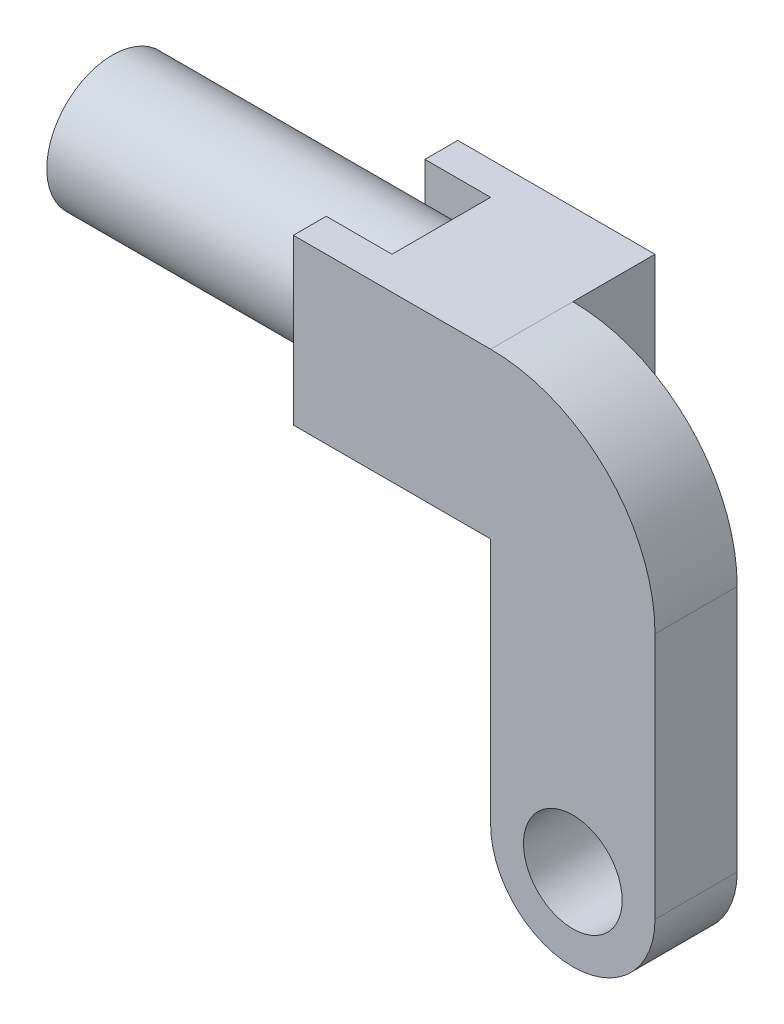
ISO-10303-21;
HEADER;
FILE_DESCRIPTION(('STEP AP214'),'2;1');
FILE_NAME('part.step','',(''),(''),'','','');
FILE_SCHEMA(('AUTOMOTIVE_DESIGN { 1 0 10303 214 1 1 1 1 }'));
ENDSEC;
DATA;
#1=APPLICATION_CONTEXT('core data for automotive mechanical design processes');
#2=APPLICATION_PROTOCOL_DEFINITION('international standard','automotive_design',2000,#1);
#3=PRODUCT_CONTEXT('',#1,'mechanical');
#4=PRODUCT('Part','Part','',(#3));
#5=PRODUCT_RELATED_PRODUCT_CATEGORY('part','',(#4));
#6=PRODUCT_DEFINITION_FORMATION('','',#4);
#7=PRODUCT_DEFINITION_CONTEXT('part definition',#1,'design');
#8=PRODUCT_DEFINITION('design','',#6,#7);
#9=PRODUCT_DEFINITION_SHAPE('','',#8);
#10=(LENGTH_UNIT() NAMED_UNIT(*) SI_UNIT(.MILLI.,.METRE.));
#11=(NAMED_UNIT(*) PLANE_ANGLE_UNIT() SI_UNIT($,.RADIAN.));
#12=(NAMED_UNIT(*) SI_UNIT($,.STERADIAN.) SOLID_ANGLE_UNIT());
#13=UNCERTAINTY_MEASURE_WITH_UNIT(LENGTH_MEASURE(1.E-05),#10,'distance_accuracy_value','');
#14=(GEOMETRIC_REPRESENTATION_CONTEXT(3) GLOBAL_UNCERTAINTY_ASSIGNED_CONTEXT((#13)) GLOBAL_UNIT_ASSIGNED_CONTEXT((#10,
#11,#12)) REPRESENTATION_CONTEXT('',''));
#15=CARTESIAN_POINT('',(0.,0.,0.));
#16=DIRECTION('',(0.,0.,1.));
#17=DIRECTION('',(1.,0.,0.));
#18=AXIS2_PLACEMENT_3D('',#15,#16,#17);
#19=CARTESIAN_POINT('',(88.9,0.,0.));
#20=DIRECTION('',(1.,0.,0.));
#21=DIRECTION('',(0.,0.,-1.));
#22=AXIS2_PLACEMENT_3D('',#19,#20,#21);
#23=PLANE('',#22);
#24=DIRECTION('',(0.,0.,1.));
#25=VECTOR('',#24,1.);
#26=CARTESIAN_POINT('',(88.9,15.875,15.875));
#27=LINE('',#26,#25);
#28=CARTESIAN_POINT('',(88.9,15.875,-15.875));
#29=VERTEX_POINT('',#28);
#30=CARTESIAN_POINT('',(88.9,15.875,0.));
#31=VERTEX_POINT('',#30);
#32=EDGE_CURVE('E294',#29,#31,#27,.T.);
#33=ORIENTED_EDGE('',*,*,#32,.T.);
#34=DIRECTION('',(0.,-1.,0.));
#35=VECTOR('',#34,1.);
#36=CARTESIAN_POINT('',(88.9,0.,0.));
#37=LINE('',#36,#35);
#38=CARTESIAN_POINT('',(88.9,-15.875,0.));
#39=VERTEX_POINT('',#38);
#40=EDGE_CURVE('E12',#31,#39,#37,.T.);
#41=ORIENTED_EDGE('',*,*,#40,.T.);
#42=DIRECTION('',(0.,0.,-1.));
#43=VECTOR('',#42,1.);
#44=CARTESIAN_POINT('',(88.9,-15.875,15.875));
#45=LINE('',#44,#43);
#46=CARTESIAN_POINT('',(88.9,-15.875,-15.875));
#47=VERTEX_POINT('',#46);
#48=EDGE_CURVE('E297',#39,#47,#45,.T.);
#49=ORIENTED_EDGE('',*,*,#48,.T.);
#50=DIRECTION('',(0.,1.,0.));
#51=VECTOR('',#50,1.);
#52=CARTESIAN_POINT('',(88.9,15.875,-15.875));
#53=LINE('',#52,#51);
#54=EDGE_CURVE('E291',#47,#29,#53,.T.);
#55=ORIENTED_EDGE('',*,*,#54,.T.);
#56=EDGE_LOOP('',(#33,#41,#49,#55));
#57=FACE_BOUND('',#56,.T.);
#58=ADVANCED_FACE('F81',(#57),#23,.T.);
#59=CARTESIAN_POINT('',(63.5,0.,0.));
#60=DIRECTION('',(-1.,0.,0.));
#61=DIRECTION('',(0.,0.,1.));
#62=AXIS2_PLACEMENT_3D('',#59,#60,#61);
#63=CYLINDRICAL_SURFACE('',#62,12.7);
#64=CARTESIAN_POINT('',(0.,0.,0.));
#65=DIRECTION('',(1.,0.,0.));
#66=DIRECTION('',(0.,0.,-1.));
#67=AXIS2_PLACEMENT_3D('',#64,#65,#66);
#68=CIRCLE('',#67,12.7);
#69=CARTESIAN_POINT('',(0.,0.,-12.7));
#70=VERTEX_POINT('',#69);
#71=EDGE_CURVE('E310',#70,#70,#68,.T.);
#72=ORIENTED_EDGE('',*,*,#71,.T.);
#73=EDGE_LOOP('',(#72));
#74=FACE_BOUND('',#73,.T.);
#75=DIRECTION('',(-1.,0.,0.));
#76=VECTOR('',#75,1.);
#77=CARTESIAN_POINT('',(63.5,8.40026041263007,9.525));
#78=LINE('',#77,#76);
#79=CARTESIAN_POINT('',(63.5,8.40026041263007,9.525));
#80=VERTEX_POINT('',#79);
#81=CARTESIAN_POINT('',(50.8,8.40026041263007,9.525));
#82=VERTEX_POINT('',#81);
#83=EDGE_CURVE('E262',#80,#82,#78,.T.);
#84=ORIENTED_EDGE('',*,*,#83,.F.);
#85=CARTESIAN_POINT('',(63.5,0.,0.));
#86=DIRECTION('',(1.,0.,0.));
#87=DIRECTION('',(0.,0.,-1.));
#88=AXIS2_PLACEMENT_3D('',#85,#86,#87);
#89=CIRCLE('',#88,12.7);
#90=CARTESIAN_POINT('',(63.5,8.40026041263007,-9.525));
#91=VERTEX_POINT('',#90);
#92=EDGE_CURVE('E311',#91,#80,#89,.T.);
#93=ORIENTED_EDGE('',*,*,#92,.F.);
#94=DIRECTION('',(-1.,0.,0.));
#95=VECTOR('',#94,1.);
#96=CARTESIAN_POINT('',(63.5,8.40026041263007,-9.525));
#97=LINE('',#96,#95);
#98=CARTESIAN_POINT('',(50.8,8.40026041263007,-9.525));
#99=VERTEX_POINT('',#98);
#100=EDGE_CURVE('E284',#99,#91,#97,.F.);
#101=ORIENTED_EDGE('',*,*,#100,.F.);
#102=CARTESIAN_POINT('',(50.8,0.,0.));
#103=DIRECTION('',(-1.,0.,0.));
#104=DIRECTION('',(0.,-1.,0.));
#105=AXIS2_PLACEMENT_3D('',#102,#103,#104);
#106=CIRCLE('',#105,12.7);
#107=CARTESIAN_POINT('',(50.8,-8.40026041263007,-9.52500000000001));
#108=VERTEX_POINT('',#107);
#109=EDGE_CURVE('E320',#99,#108,#106,.T.);
#110=ORIENTED_EDGE('',*,*,#109,.T.);
#111=DIRECTION('',(-1.,0.,0.));
#112=VECTOR('',#111,1.);
#113=CARTESIAN_POINT('',(63.5,-8.40026041263007,-9.52500000000001));
#114=LINE('',#113,#112);
#115=CARTESIAN_POINT('',(63.5,-8.40026041263007,-9.52500000000001));
#116=VERTEX_POINT('',#115);
#117=EDGE_CURVE('E288',#116,#108,#114,.T.);
#118=ORIENTED_EDGE('',*,*,#117,.F.);
#119=CARTESIAN_POINT('',(63.5,-8.40026041263007,9.52500000000001));
#120=VERTEX_POINT('',#119);
#121=EDGE_CURVE('E315',#120,#116,#89,.T.);
#122=ORIENTED_EDGE('',*,*,#121,.F.);
#123=DIRECTION('',(-1.,0.,0.));
#124=VECTOR('',#123,1.);
#125=CARTESIAN_POINT('',(63.5,-8.40026041263007,9.52500000000001));
#126=LINE('',#125,#124);
#127=CARTESIAN_POINT('',(50.8,-8.40026041263007,9.52500000000001));
#128=VERTEX_POINT('',#127);
#129=EDGE_CURVE('E258',#128,#120,#126,.F.);
#130=ORIENTED_EDGE('',*,*,#129,.F.);
#131=CARTESIAN_POINT('',(50.8,0.,0.));
#132=DIRECTION('',(1.,0.,0.));
#133=DIRECTION('',(0.,1.,0.));
#134=AXIS2_PLACEMENT_3D('',#131,#132,#133);
#135=CIRCLE('',#134,12.7);
#136=EDGE_CURVE('E89',#82,#128,#135,.T.);
#137=ORIENTED_EDGE('',*,*,#136,.F.);
#138=EDGE_LOOP('',(#84,#93,#101,#110,#118,#122,#130,#137));
#139=FACE_BOUND('',#138,.T.);
#140=ADVANCED_FACE('F83',(#74,#139),#63,.T.);
#141=CARTESIAN_POINT('',(63.5,0.,0.));
#142=DIRECTION('',(1.,0.,0.));
#143=DIRECTION('',(0.,0.,-1.));
#144=AXIS2_PLACEMENT_3D('',#141,#142,#143);
#145=PLANE('',#144);
#146=DIRECTION('',(0.,-1.,0.));
#147=VECTOR('',#146,1.);
#148=CARTESIAN_POINT('',(63.5,15.875,9.525));
#149=LINE('',#148,#147);
#150=CARTESIAN_POINT('',(63.5,15.875,9.525));
#151=VERTEX_POINT('',#150);
#152=EDGE_CURVE('E241',#151,#80,#149,.T.);
#153=ORIENTED_EDGE('',*,*,#152,.F.);
#154=DIRECTION('',(0.,0.,1.));
#155=VECTOR('',#154,1.);
#156=CARTESIAN_POINT('',(63.5,15.875,15.875));
#157=LINE('',#156,#155);
#158=CARTESIAN_POINT('',(63.5,15.875,-9.525));
#159=VERTEX_POINT('',#158);
#160=EDGE_CURVE('E290',#159,#151,#157,.T.);
#161=ORIENTED_EDGE('',*,*,#160,.F.);
#162=DIRECTION('',(0.,-1.,0.));
#163=VECTOR('',#162,1.);
#164=CARTESIAN_POINT('',(63.5,15.875,-9.525));
#165=LINE('',#164,#163);
#166=EDGE_CURVE('E265',#159,#91,#165,.T.);
#167=ORIENTED_EDGE('',*,*,#166,.T.);
#168=ORIENTED_EDGE('',*,*,#92,.T.);
#169=EDGE_LOOP('',(#153,#161,#167,#168));
#170=FACE_BOUND('',#169,.T.);
#171=ADVANCED_FACE('F382',(#170),#145,.F.);
#172=CARTESIAN_POINT('',(63.5,-15.875,9.52500000000001));
#173=VERTEX_POINT('',#172);
#174=EDGE_CURVE('E244',#120,#173,#149,.T.);
#175=ORIENTED_EDGE('',*,*,#174,.F.);
#176=ORIENTED_EDGE('',*,*,#121,.T.);
#177=DIRECTION('',(0.,1.,0.));
#178=VECTOR('',#177,1.);
#179=CARTESIAN_POINT('',(63.5,0.,-9.525));
#180=LINE('',#179,#178);
#181=CARTESIAN_POINT('',(63.5,-15.875,-9.52500000000001));
#182=VERTEX_POINT('',#181);
#183=EDGE_CURVE('E314',#182,#116,#180,.T.);
#184=ORIENTED_EDGE('',*,*,#183,.F.);
#185=DIRECTION('',(0.,0.,-1.));
#186=VECTOR('',#185,1.);
#187=CARTESIAN_POINT('',(63.5,-15.875,15.875));
#188=LINE('',#187,#186);
#189=EDGE_CURVE('E295',#173,#182,#188,.T.);
#190=ORIENTED_EDGE('',*,*,#189,.F.);
#191=EDGE_LOOP('',(#175,#176,#184,#190));
#192=FACE_BOUND('',#191,.T.);
#193=ADVANCED_FACE('F340',(#192),#145,.F.);
#194=CARTESIAN_POINT('',(0.,0.,0.));
#195=DIRECTION('',(1.,0.,0.));
#196=DIRECTION('',(0.,0.,-1.));
#197=AXIS2_PLACEMENT_3D('',#194,#195,#196);
#198=PLANE('',#197);
#199=ORIENTED_EDGE('',*,*,#71,.F.);
#200=EDGE_LOOP('',(#199));
#201=FACE_BOUND('',#200,.T.);
#202=ADVANCED_FACE('F398',(#201),#198,.F.);
#203=CARTESIAN_POINT('',(88.9,15.875,-15.875));
#204=DIRECTION('',(0.,0.,1.));
#205=DIRECTION('',(0.,-1.,0.));
#206=AXIS2_PLACEMENT_3D('',#203,#204,#205);
#207=PLANE('',#206);
#208=DIRECTION('',(-1.,0.,0.));
#209=VECTOR('',#208,1.);
#210=CARTESIAN_POINT('',(88.9,-15.875,-15.875));
#211=LINE('',#210,#209);
#212=CARTESIAN_POINT('',(50.8,-15.875,-15.875));
#213=VERTEX_POINT('',#212);
#214=EDGE_CURVE('E299',#47,#213,#211,.T.);
#215=ORIENTED_EDGE('',*,*,#214,.T.);
#216=DIRECTION('',(0.,1.,0.));
#217=VECTOR('',#216,1.);
#218=CARTESIAN_POINT('',(50.8,15.875,-15.875));
#219=LINE('',#218,#217);
#220=CARTESIAN_POINT('',(50.8,15.875,-15.875));
#221=VERTEX_POINT('',#220);
#222=EDGE_CURVE('E264',#213,#221,#219,.T.);
#223=ORIENTED_EDGE('',*,*,#222,.T.);
#224=DIRECTION('',(-1.,0.,0.));
#225=VECTOR('',#224,1.);
#226=CARTESIAN_POINT('',(88.9,15.875,-15.875));
#227=LINE('',#226,#225);
#228=EDGE_CURVE('E308',#29,#221,#227,.T.);
#229=ORIENTED_EDGE('',*,*,#228,.F.);
#230=ORIENTED_EDGE('',*,*,#54,.F.);
#231=EDGE_LOOP('',(#215,#223,#229,#230));
#232=FACE_BOUND('',#231,.T.);
#233=ADVANCED_FACE('F396',(#232),#207,.F.);
#234=CARTESIAN_POINT('',(88.9,15.875,15.875));
#235=DIRECTION('',(0.,-1.,0.));
#236=DIRECTION('',(0.,0.,-1.));
#237=AXIS2_PLACEMENT_3D('',#234,#235,#236);
#238=PLANE('',#237);
#239=ORIENTED_EDGE('',*,*,#228,.T.);
#240=DIRECTION('',(0.,0.,-1.));
#241=VECTOR('',#240,1.);
#242=CARTESIAN_POINT('',(50.8,15.875,-9.525));
#243=LINE('',#242,#241);
#244=CARTESIAN_POINT('',(50.8,15.875,-9.525));
#245=VERTEX_POINT('',#244);
#246=EDGE_CURVE('E281',#245,#221,#243,.T.);
#247=ORIENTED_EDGE('',*,*,#246,.F.);
#248=DIRECTION('',(1.,0.,0.));
#249=VECTOR('',#248,1.);
#250=CARTESIAN_POINT('',(63.5,15.875,-9.525));
#251=LINE('',#250,#249);
#252=EDGE_CURVE('E275',#245,#159,#251,.T.);
#253=ORIENTED_EDGE('',*,*,#252,.T.);
#254=ORIENTED_EDGE('',*,*,#160,.T.);
#255=DIRECTION('',(1.,0.,0.));
#256=VECTOR('',#255,1.);
#257=CARTESIAN_POINT('',(63.5,15.875,9.525));
#258=LINE('',#257,#256);
#259=CARTESIAN_POINT('',(50.8,15.875,9.525));
#260=VERTEX_POINT('',#259);
#261=EDGE_CURVE('E243',#260,#151,#258,.T.);
#262=ORIENTED_EDGE('',*,*,#261,.F.);
#263=DIRECTION('',(0.,0.,1.));
#264=VECTOR('',#263,1.);
#265=CARTESIAN_POINT('',(50.8,15.875,9.525));
#266=LINE('',#265,#264);
#267=CARTESIAN_POINT('',(50.8,15.875,15.875));
#268=VERTEX_POINT('',#267);
#269=EDGE_CURVE('E252',#260,#268,#266,.T.);
#270=ORIENTED_EDGE('',*,*,#269,.T.);
#271=DIRECTION('',(-1.,0.,0.));
#272=VECTOR('',#271,1.);
#273=CARTESIAN_POINT('',(88.9,15.875,15.875));
#274=LINE('',#273,#272);
#275=CARTESIAN_POINT('',(88.9,15.875,15.875));
#276=VERTEX_POINT('',#275);
#277=EDGE_CURVE('E306',#276,#268,#274,.T.);
#278=ORIENTED_EDGE('',*,*,#277,.F.);
#279=DIRECTION('',(0.,0.,1.));
#280=VECTOR('',#279,1.);
#281=CARTESIAN_POINT('',(88.9,15.875,0.));
#282=LINE('',#281,#280);
#283=EDGE_CURVE('E102',#31,#276,#282,.T.);
#284=ORIENTED_EDGE('',*,*,#283,.F.);
#285=ORIENTED_EDGE('',*,*,#32,.F.);
#286=EDGE_LOOP('',(#239,#247,#253,#254,#262,#270,#278,#284,#285));
#287=FACE_BOUND('',#286,.T.);
#288=ADVANCED_FACE('F356',(#287),#238,.F.);
#289=CARTESIAN_POINT('',(88.9,15.875,15.875));
#290=DIRECTION('',(0.,0.,-1.));
#291=DIRECTION('',(0.,1.,0.));
#292=AXIS2_PLACEMENT_3D('',#289,#290,#291);
#293=PLANE('',#292);
#294=ORIENTED_EDGE('',*,*,#277,.T.);
#295=DIRECTION('',(0.,1.,0.));
#296=VECTOR('',#295,1.);
#297=CARTESIAN_POINT('',(50.8,15.875,15.875));
#298=LINE('',#297,#296);
#299=CARTESIAN_POINT('',(50.8,-15.875,15.875));
#300=VERTEX_POINT('',#299);
#301=EDGE_CURVE('E231',#300,#268,#298,.T.);
#302=ORIENTED_EDGE('',*,*,#301,.F.);
#303=DIRECTION('',(-1.,0.,0.));
#304=VECTOR('',#303,1.);
#305=CARTESIAN_POINT('',(88.9,-15.875,15.875));
#306=LINE('',#305,#304);
#307=CARTESIAN_POINT('',(88.9,-15.875,15.875));
#308=VERTEX_POINT('',#307);
#309=EDGE_CURVE('E304',#308,#300,#306,.T.);
#310=ORIENTED_EDGE('',*,*,#309,.F.);
#311=DIRECTION('',(0.,1.,0.));
#312=VECTOR('',#311,1.);
#313=CARTESIAN_POINT('',(88.9,0.,15.875));
#314=LINE('',#313,#312);
#315=CARTESIAN_POINT('',(88.9,-63.627,15.875));
#316=VERTEX_POINT('',#315);
#317=EDGE_CURVE('E225',#316,#308,#314,.T.);
#318=ORIENTED_EDGE('',*,*,#317,.F.);
#319=CARTESIAN_POINT('',(104.775,-63.627,15.875));
#320=DIRECTION('',(0.,0.,1.));
#321=DIRECTION('',(1.,0.,0.));
#322=AXIS2_PLACEMENT_3D('',#319,#320,#321);
#323=CIRCLE('',#322,15.875);
#324=CARTESIAN_POINT('',(120.65,-63.627,15.875));
#325=VERTEX_POINT('',#324);
#326=EDGE_CURVE('E198',#316,#325,#323,.T.);
#327=ORIENTED_EDGE('',*,*,#326,.T.);
#328=DIRECTION('',(0.,1.,0.));
#329=VECTOR('',#328,1.);
#330=CARTESIAN_POINT('',(120.65,0.,15.875));
#331=LINE('',#330,#329);
#332=CARTESIAN_POINT('',(120.65,-15.875,15.875));
#333=VERTEX_POINT('',#332);
#334=EDGE_CURVE('E220',#325,#333,#331,.T.);
#335=ORIENTED_EDGE('',*,*,#334,.T.);
#336=CARTESIAN_POINT('',(88.9,-15.875,15.875));
#337=DIRECTION('',(0.,0.,1.));
#338=DIRECTION('',(1.,0.,0.));
#339=AXIS2_PLACEMENT_3D('',#336,#337,#338);
#340=CIRCLE('',#339,31.75);
#341=EDGE_CURVE('E212',#276,#333,#340,.F.);
#342=ORIENTED_EDGE('',*,*,#341,.F.);
#343=EDGE_LOOP('',(#294,#302,#310,#318,#327,#335,#342));
#344=FACE_BOUND('',#343,.T.);
#345=CARTESIAN_POINT('',(104.775,-63.627,15.875));
#346=DIRECTION('',(0.,0.,1.));
#347=DIRECTION('',(1.,0.,0.));
#348=AXIS2_PLACEMENT_3D('',#345,#346,#347);
#349=CIRCLE('',#348,9.52500000000001);
#350=CARTESIAN_POINT('',(114.3,-63.627,15.875));
#351=VERTEX_POINT('',#350);
#352=EDGE_CURVE('E237',#351,#351,#349,.T.);
#353=ORIENTED_EDGE('',*,*,#352,.F.);
#354=EDGE_LOOP('',(#353));
#355=FACE_BOUND('',#354,.T.);
#356=ADVANCED_FACE('F353',(#344,#355),#293,.F.);
#357=CARTESIAN_POINT('',(88.9,-15.875,15.875));
#358=DIRECTION('',(0.,1.,0.));
#359=DIRECTION('',(0.,0.,1.));
#360=AXIS2_PLACEMENT_3D('',#357,#358,#359);
#361=PLANE('',#360);
#362=ORIENTED_EDGE('',*,*,#309,.T.);
#363=DIRECTION('',(0.,0.,1.));
#364=VECTOR('',#363,1.);
#365=CARTESIAN_POINT('',(50.8,-15.875,9.52500000000001));
#366=LINE('',#365,#364);
#367=CARTESIAN_POINT('',(50.8,-15.875,9.52500000000001));
#368=VERTEX_POINT('',#367);
#369=EDGE_CURVE('E255',#368,#300,#366,.T.);
#370=ORIENTED_EDGE('',*,*,#369,.F.);
#371=DIRECTION('',(-1.,0.,0.));
#372=VECTOR('',#371,1.);
#373=CARTESIAN_POINT('',(63.5,-15.875,9.52500000000001));
#374=LINE('',#373,#372);
#375=EDGE_CURVE('E250',#173,#368,#374,.T.);
#376=ORIENTED_EDGE('',*,*,#375,.F.);
#377=ORIENTED_EDGE('',*,*,#189,.T.);
#378=DIRECTION('',(-1.,0.,0.));
#379=VECTOR('',#378,1.);
#380=CARTESIAN_POINT('',(63.5,-15.875,-9.52500000000001));
#381=LINE('',#380,#379);
#382=CARTESIAN_POINT('',(50.8,-15.875,-9.52500000000001));
#383=VERTEX_POINT('',#382);
#384=EDGE_CURVE('E268',#182,#383,#381,.T.);
#385=ORIENTED_EDGE('',*,*,#384,.T.);
#386=DIRECTION('',(0.,0.,-1.));
#387=VECTOR('',#386,1.);
#388=CARTESIAN_POINT('',(50.8,-15.875,-9.52500000000001));
#389=LINE('',#388,#387);
#390=EDGE_CURVE('E278',#383,#213,#389,.T.);
#391=ORIENTED_EDGE('',*,*,#390,.T.);
#392=ORIENTED_EDGE('',*,*,#214,.F.);
#393=ORIENTED_EDGE('',*,*,#48,.F.);
#394=EDGE_CURVE('E216',#308,#39,#45,.T.);
#395=ORIENTED_EDGE('',*,*,#394,.F.);
#396=EDGE_LOOP('',(#362,#370,#376,#377,#385,#391,#392,#393,#395));
#397=FACE_BOUND('',#396,.T.);
#398=ADVANCED_FACE('F347',(#397),#361,.F.);
#399=CARTESIAN_POINT('',(0.,0.,-9.525));
#400=DIRECTION('',(0.,0.,-1.));
#401=DIRECTION('',(0.,1.,0.));
#402=AXIS2_PLACEMENT_3D('',#399,#400,#401);
#403=PLANE('',#402);
#404=ORIENTED_EDGE('',*,*,#183,.T.);
#405=ORIENTED_EDGE('',*,*,#117,.T.);
#406=DIRECTION('',(0.,1.,0.));
#407=VECTOR('',#406,1.);
#408=CARTESIAN_POINT('',(50.8,15.875,-9.525));
#409=LINE('',#408,#407);
#410=EDGE_CURVE('E272',#383,#108,#409,.T.);
#411=ORIENTED_EDGE('',*,*,#410,.F.);
#412=ORIENTED_EDGE('',*,*,#384,.F.);
#413=EDGE_LOOP('',(#404,#405,#411,#412));
#414=FACE_BOUND('',#413,.T.);
#415=ADVANCED_FACE('F344',(#414),#403,.F.);
#416=EDGE_CURVE('E271',#99,#245,#409,.T.);
#417=ORIENTED_EDGE('',*,*,#416,.F.);
#418=ORIENTED_EDGE('',*,*,#100,.T.);
#419=ORIENTED_EDGE('',*,*,#166,.F.);
#420=ORIENTED_EDGE('',*,*,#252,.F.);
#421=EDGE_LOOP('',(#417,#418,#419,#420));
#422=FACE_BOUND('',#421,.T.);
#423=ADVANCED_FACE('F508',(#422),#403,.F.);
#424=CARTESIAN_POINT('',(50.8,15.875,-9.525));
#425=DIRECTION('',(-1.,0.,0.));
#426=DIRECTION('',(0.,-1.,0.));
#427=AXIS2_PLACEMENT_3D('',#424,#425,#426);
#428=PLANE('',#427);
#429=ORIENTED_EDGE('',*,*,#109,.F.);
#430=ORIENTED_EDGE('',*,*,#416,.T.);
#431=ORIENTED_EDGE('',*,*,#246,.T.);
#432=ORIENTED_EDGE('',*,*,#222,.F.);
#433=ORIENTED_EDGE('',*,*,#390,.F.);
#434=ORIENTED_EDGE('',*,*,#410,.T.);
#435=EDGE_LOOP('',(#429,#430,#431,#432,#433,#434));
#436=FACE_BOUND('',#435,.T.);
#437=ADVANCED_FACE('F386',(#436),#428,.T.);
#438=CARTESIAN_POINT('',(0.,0.,9.525));
#439=DIRECTION('',(0.,0.,1.));
#440=DIRECTION('',(0.,1.,0.));
#441=AXIS2_PLACEMENT_3D('',#438,#439,#440);
#442=PLANE('',#441);
#443=ORIENTED_EDGE('',*,*,#152,.T.);
#444=ORIENTED_EDGE('',*,*,#83,.T.);
#445=DIRECTION('',(0.,1.,0.));
#446=VECTOR('',#445,1.);
#447=CARTESIAN_POINT('',(50.8,15.875,9.525));
#448=LINE('',#447,#446);
#449=EDGE_CURVE('E246',#82,#260,#448,.T.);
#450=ORIENTED_EDGE('',*,*,#449,.T.);
#451=ORIENTED_EDGE('',*,*,#261,.T.);
#452=EDGE_LOOP('',(#443,#444,#450,#451));
#453=FACE_BOUND('',#452,.T.);
#454=ADVANCED_FACE('F415',(#453),#442,.F.);
#455=EDGE_CURVE('E247',#368,#128,#448,.T.);
#456=ORIENTED_EDGE('',*,*,#455,.T.);
#457=ORIENTED_EDGE('',*,*,#129,.T.);
#458=ORIENTED_EDGE('',*,*,#174,.T.);
#459=ORIENTED_EDGE('',*,*,#375,.T.);
#460=EDGE_LOOP('',(#456,#457,#458,#459));
#461=FACE_BOUND('',#460,.T.);
#462=ADVANCED_FACE('F332',(#461),#442,.F.);
#463=CARTESIAN_POINT('',(50.8,15.875,9.525));
#464=DIRECTION('',(1.,0.,0.));
#465=DIRECTION('',(0.,1.,0.));
#466=AXIS2_PLACEMENT_3D('',#463,#464,#465);
#467=PLANE('',#466);
#468=ORIENTED_EDGE('',*,*,#449,.F.);
#469=ORIENTED_EDGE('',*,*,#136,.T.);
#470=ORIENTED_EDGE('',*,*,#455,.F.);
#471=ORIENTED_EDGE('',*,*,#369,.T.);
#472=ORIENTED_EDGE('',*,*,#301,.T.);
#473=ORIENTED_EDGE('',*,*,#269,.F.);
#474=EDGE_LOOP('',(#468,#469,#470,#471,#472,#473));
#475=FACE_BOUND('',#474,.T.);
#476=ADVANCED_FACE('F326',(#475),#467,.F.);
#477=CARTESIAN_POINT('',(88.9,0.,0.));
#478=DIRECTION('',(1.,0.,0.));
#479=DIRECTION('',(0.,0.,-1.));
#480=AXIS2_PLACEMENT_3D('',#477,#478,#479);
#481=PLANE('',#480);
#482=ORIENTED_EDGE('',*,*,#317,.T.);
#483=ORIENTED_EDGE('',*,*,#394,.T.);
#484=DIRECTION('',(0.,1.,0.));
#485=VECTOR('',#484,1.);
#486=CARTESIAN_POINT('',(88.9,0.,0.));
#487=LINE('',#486,#485);
#488=CARTESIAN_POINT('',(88.9,-63.627,0.));
#489=VERTEX_POINT('',#488);
#490=EDGE_CURVE('E209',#489,#39,#487,.T.);
#491=ORIENTED_EDGE('',*,*,#490,.F.);
#492=DIRECTION('',(0.,0.,1.));
#493=VECTOR('',#492,1.);
#494=CARTESIAN_POINT('',(88.9,-63.627,0.));
#495=LINE('',#494,#493);
#496=EDGE_CURVE('E192',#489,#316,#495,.T.);
#497=ORIENTED_EDGE('',*,*,#496,.T.);
#498=EDGE_LOOP('',(#482,#483,#491,#497));
#499=FACE_BOUND('',#498,.T.);
#500=ADVANCED_FACE('F215',(#499),#481,.F.);
#501=CARTESIAN_POINT('',(88.9,-15.875,0.));
#502=DIRECTION('',(0.,0.,1.));
#503=DIRECTION('',(1.,0.,0.));
#504=AXIS2_PLACEMENT_3D('',#501,#502,#503);
#505=CYLINDRICAL_SURFACE('',#504,31.75);
#506=ORIENTED_EDGE('',*,*,#341,.T.);
#507=DIRECTION('',(0.,0.,1.));
#508=VECTOR('',#507,1.);
#509=CARTESIAN_POINT('',(120.65,-15.875,0.));
#510=LINE('',#509,#508);
#511=CARTESIAN_POINT('',(120.65,-15.875,0.));
#512=VERTEX_POINT('',#511);
#513=EDGE_CURVE('E229',#512,#333,#510,.T.);
#514=ORIENTED_EDGE('',*,*,#513,.F.);
#515=CARTESIAN_POINT('',(88.9,-15.875,0.));
#516=DIRECTION('',(0.,0.,1.));
#517=DIRECTION('',(1.,0.,0.));
#518=AXIS2_PLACEMENT_3D('',#515,#516,#517);
#519=CIRCLE('',#518,31.75);
#520=EDGE_CURVE('E217',#31,#512,#519,.F.);
#521=ORIENTED_EDGE('',*,*,#520,.F.);
#522=ORIENTED_EDGE('',*,*,#283,.T.);
#523=EDGE_LOOP('',(#506,#514,#521,#522));
#524=FACE_BOUND('',#523,.T.);
#525=ADVANCED_FACE('F360',(#524),#505,.T.);
#526=CARTESIAN_POINT('',(120.65,0.,0.));
#527=DIRECTION('',(1.,0.,0.));
#528=DIRECTION('',(0.,0.,-1.));
#529=AXIS2_PLACEMENT_3D('',#526,#527,#528);
#530=PLANE('',#529);
#531=ORIENTED_EDGE('',*,*,#334,.F.);
#532=DIRECTION('',(0.,0.,1.));
#533=VECTOR('',#532,1.);
#534=CARTESIAN_POINT('',(120.65,-63.627,0.));
#535=LINE('',#534,#533);
#536=CARTESIAN_POINT('',(120.65,-63.627,0.));
#537=VERTEX_POINT('',#536);
#538=EDGE_CURVE('E203',#537,#325,#535,.T.);
#539=ORIENTED_EDGE('',*,*,#538,.F.);
#540=DIRECTION('',(0.,1.,0.));
#541=VECTOR('',#540,1.);
#542=CARTESIAN_POINT('',(120.65,0.,0.));
#543=LINE('',#542,#541);
#544=EDGE_CURVE('E211',#537,#512,#543,.T.);
#545=ORIENTED_EDGE('',*,*,#544,.T.);
#546=ORIENTED_EDGE('',*,*,#513,.T.);
#547=EDGE_LOOP('',(#531,#539,#545,#546));
#548=FACE_BOUND('',#547,.T.);
#549=ADVANCED_FACE('F364',(#548),#530,.T.);
#550=CARTESIAN_POINT('',(0.,0.,0.));
#551=DIRECTION('',(0.,0.,1.));
#552=DIRECTION('',(1.,0.,0.));
#553=AXIS2_PLACEMENT_3D('',#550,#551,#552);
#554=PLANE('',#553);
#555=ORIENTED_EDGE('',*,*,#520,.T.);
#556=ORIENTED_EDGE('',*,*,#544,.F.);
#557=CARTESIAN_POINT('',(104.775,-63.627,0.));
#558=DIRECTION('',(0.,0.,1.));
#559=DIRECTION('',(1.,0.,0.));
#560=AXIS2_PLACEMENT_3D('',#557,#558,#559);
#561=CIRCLE('',#560,15.875);
#562=EDGE_CURVE('E195',#489,#537,#561,.T.);
#563=ORIENTED_EDGE('',*,*,#562,.F.);
#564=ORIENTED_EDGE('',*,*,#490,.T.);
#565=ORIENTED_EDGE('',*,*,#40,.F.);
#566=EDGE_LOOP('',(#555,#556,#563,#564,#565));
#567=FACE_BOUND('',#566,.T.);
#568=CARTESIAN_POINT('',(104.775,-63.627,0.));
#569=DIRECTION('',(0.,0.,1.));
#570=DIRECTION('',(1.,0.,0.));
#571=AXIS2_PLACEMENT_3D('',#568,#569,#570);
#572=CIRCLE('',#571,9.52500000000001);
#573=CARTESIAN_POINT('',(114.3,-63.627,0.));
#574=VERTEX_POINT('',#573);
#575=EDGE_CURVE('E234',#574,#574,#572,.T.);
#576=ORIENTED_EDGE('',*,*,#575,.T.);
#577=EDGE_LOOP('',(#576));
#578=FACE_BOUND('',#577,.T.);
#579=ADVANCED_FACE('F207',(#567,#578),#554,.F.);
#580=CARTESIAN_POINT('',(104.775,-63.627,0.));
#581=DIRECTION('',(0.,0.,1.));
#582=DIRECTION('',(1.,0.,0.));
#583=AXIS2_PLACEMENT_3D('',#580,#581,#582);
#584=CYLINDRICAL_SURFACE('',#583,15.875);
#585=ORIENTED_EDGE('',*,*,#562,.T.);
#586=ORIENTED_EDGE('',*,*,#538,.T.);
#587=ORIENTED_EDGE('',*,*,#326,.F.);
#588=ORIENTED_EDGE('',*,*,#496,.F.);
#589=EDGE_LOOP('',(#585,#586,#587,#588));
#590=FACE_BOUND('',#589,.T.);
#591=ADVANCED_FACE('F194',(#590),#584,.T.);
#592=CARTESIAN_POINT('',(104.775,-63.627,0.));
#593=DIRECTION('',(0.,0.,1.));
#594=DIRECTION('',(1.,0.,0.));
#595=AXIS2_PLACEMENT_3D('',#592,#593,#594);
#596=CYLINDRICAL_SURFACE('',#595,9.52500000000001);
#597=ORIENTED_EDGE('',*,*,#575,.F.);
#598=EDGE_LOOP('',(#597));
#599=FACE_BOUND('',#598,.T.);
#600=ORIENTED_EDGE('',*,*,#352,.T.);
#601=EDGE_LOOP('',(#600));
#602=FACE_BOUND('',#601,.T.);
#603=ADVANCED_FACE('F373',(#599,#602),#596,.F.);
#604=CLOSED_SHELL('',(#58,#140,#171,#193,#202,#233,#288,#356,#398,#415,#423,#437,#454,#462,#476,
#500,#525,#549,#579,#591,#603));
#605=MANIFOLD_SOLID_BREP('B2',#604);
#606=ADVANCED_BREP_SHAPE_REPRESENTATION('',(#18,#605),#14);
#607=SHAPE_DEFINITION_REPRESENTATION(#9,#606);
ENDSEC;
END-ISO-10303-21;
